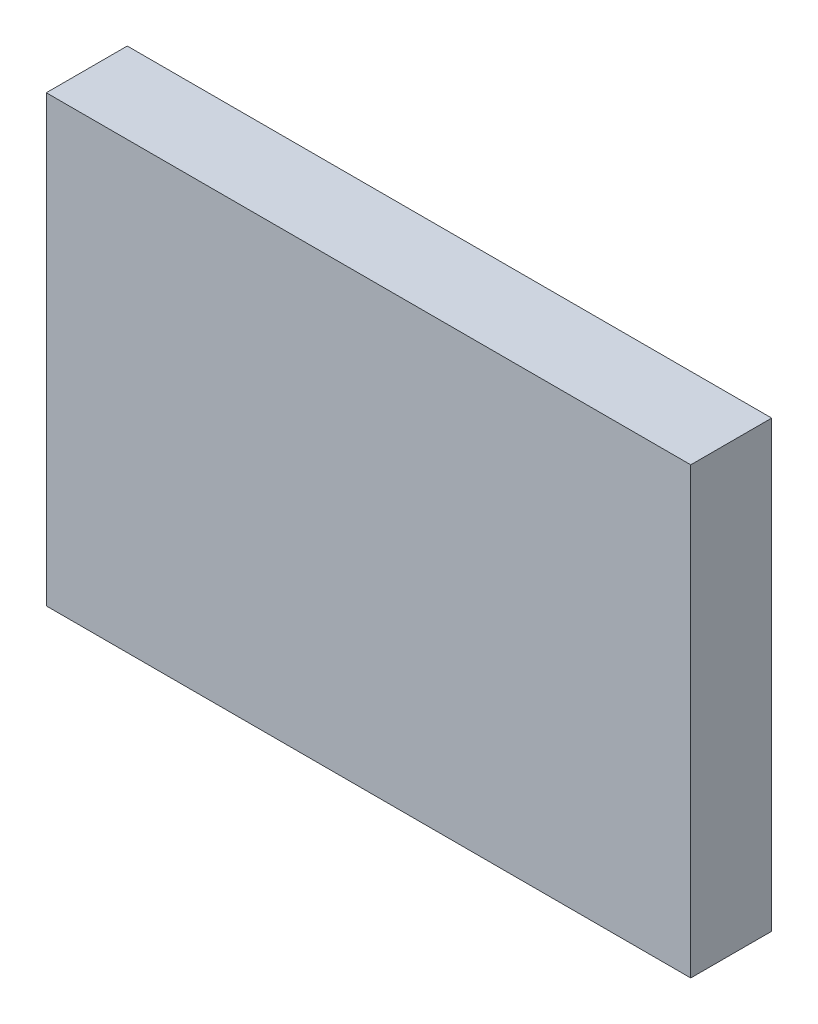
ISO-10303-21;
HEADER;
FILE_DESCRIPTION(('STEP AP214'),'2;1');
FILE_NAME('part.step','',(''),(''),'','','');
FILE_SCHEMA(('AUTOMOTIVE_DESIGN { 1 0 10303 214 1 1 1 1 }'));
ENDSEC;
DATA;
#1=APPLICATION_CONTEXT('core data for automotive mechanical design processes');
#2=APPLICATION_PROTOCOL_DEFINITION('international standard','automotive_design',2000,#1);
#3=PRODUCT_CONTEXT('',#1,'mechanical');
#4=PRODUCT('Part','Part','',(#3));
#5=PRODUCT_RELATED_PRODUCT_CATEGORY('part','',(#4));
#6=PRODUCT_DEFINITION_FORMATION('','',#4);
#7=PRODUCT_DEFINITION_CONTEXT('part definition',#1,'design');
#8=PRODUCT_DEFINITION('design','',#6,#7);
#9=PRODUCT_DEFINITION_SHAPE('','',#8);
#10=(LENGTH_UNIT() NAMED_UNIT(*) SI_UNIT(.MILLI.,.METRE.));
#11=(NAMED_UNIT(*) PLANE_ANGLE_UNIT() SI_UNIT($,.RADIAN.));
#12=(NAMED_UNIT(*) SI_UNIT($,.STERADIAN.) SOLID_ANGLE_UNIT());
#13=UNCERTAINTY_MEASURE_WITH_UNIT(LENGTH_MEASURE(1.E-05),#10,'distance_accuracy_value','');
#14=(GEOMETRIC_REPRESENTATION_CONTEXT(3) GLOBAL_UNCERTAINTY_ASSIGNED_CONTEXT((#13)) GLOBAL_UNIT_ASSIGNED_CONTEXT((#10,
#11,#12)) REPRESENTATION_CONTEXT('',''));
#15=CARTESIAN_POINT('',(0.,0.,0.));
#16=DIRECTION('',(0.,0.,1.));
#17=DIRECTION('',(1.,0.,0.));
#18=AXIS2_PLACEMENT_3D('',#15,#16,#17);
#19=CARTESIAN_POINT('',(-1.549,-0.14,0.));
#20=DIRECTION('',(0.,-1.,0.));
#21=DIRECTION('',(0.,0.,-1.));
#22=AXIS2_PLACEMENT_3D('',#19,#20,#21);
#23=PLANE('',#22);
#24=DIRECTION('',(-1.,0.,0.));
#25=VECTOR('',#24,1.);
#26=CARTESIAN_POINT('',(-1.143,-0.14,0.));
#27=LINE('',#26,#25);
#28=CARTESIAN_POINT('',(-1.143,-0.14,0.));
#29=VERTEX_POINT('',#28);
#30=CARTESIAN_POINT('',(-1.549,-0.14,0.));
#31=VERTEX_POINT('',#30);
#32=EDGE_CURVE('E11',#29,#31,#27,.T.);
#33=ORIENTED_EDGE('',*,*,#32,.F.);
#34=DIRECTION('',(0.,0.,-1.));
#35=VECTOR('',#34,1.);
#36=CARTESIAN_POINT('',(-1.143,-0.14,0.051));
#37=LINE('',#36,#35);
#38=CARTESIAN_POINT('',(-1.143,-0.14,0.051));
#39=VERTEX_POINT('',#38);
#40=EDGE_CURVE('E24',#39,#29,#37,.T.);
#41=ORIENTED_EDGE('',*,*,#40,.F.);
#42=DIRECTION('',(1.,0.,0.));
#43=VECTOR('',#42,1.);
#44=CARTESIAN_POINT('',(-1.549,-0.14,0.051));
#45=LINE('',#44,#43);
#46=CARTESIAN_POINT('',(-1.549,-0.14,0.051));
#47=VERTEX_POINT('',#46);
#48=EDGE_CURVE('E88',#47,#39,#45,.T.);
#49=ORIENTED_EDGE('',*,*,#48,.F.);
#50=DIRECTION('',(0.,0.,1.));
#51=VECTOR('',#50,1.);
#52=CARTESIAN_POINT('',(-1.549,-0.14,0.));
#53=LINE('',#52,#51);
#54=EDGE_CURVE('E77',#31,#47,#53,.T.);
#55=ORIENTED_EDGE('',*,*,#54,.F.);
#56=EDGE_LOOP('',(#33,#41,#49,#55));
#57=FACE_BOUND('',#56,.T.);
#58=ADVANCED_FACE('F17',(#57),#23,.T.);
#59=CARTESIAN_POINT('',(-1.143,-0.14,0.));
#60=DIRECTION('',(1.,0.,0.));
#61=DIRECTION('',(0.,1.,0.));
#62=AXIS2_PLACEMENT_3D('',#59,#60,#61);
#63=PLANE('',#62);
#64=DIRECTION('',(0.,-1.,0.));
#65=VECTOR('',#64,1.);
#66=CARTESIAN_POINT('',(-1.143,0.14,0.));
#67=LINE('',#66,#65);
#68=CARTESIAN_POINT('',(-1.143,0.14,0.));
#69=VERTEX_POINT('',#68);
#70=EDGE_CURVE('E85',#69,#29,#67,.T.);
#71=ORIENTED_EDGE('',*,*,#70,.F.);
#72=DIRECTION('',(0.,0.,-1.));
#73=VECTOR('',#72,1.);
#74=CARTESIAN_POINT('',(-1.143,0.14,0.051));
#75=LINE('',#74,#73);
#76=CARTESIAN_POINT('',(-1.143,0.14,0.051));
#77=VERTEX_POINT('',#76);
#78=EDGE_CURVE('E83',#77,#69,#75,.T.);
#79=ORIENTED_EDGE('',*,*,#78,.F.);
#80=DIRECTION('',(0.,1.,0.));
#81=VECTOR('',#80,1.);
#82=CARTESIAN_POINT('',(-1.143,-0.14,0.051));
#83=LINE('',#82,#81);
#84=EDGE_CURVE('E72',#39,#77,#83,.T.);
#85=ORIENTED_EDGE('',*,*,#84,.F.);
#86=ORIENTED_EDGE('',*,*,#40,.T.);
#87=EDGE_LOOP('',(#71,#79,#85,#86));
#88=FACE_BOUND('',#87,.T.);
#89=ADVANCED_FACE('F90',(#88),#63,.T.);
#90=CARTESIAN_POINT('',(-1.143,0.14,0.));
#91=DIRECTION('',(0.,1.,0.));
#92=DIRECTION('',(1.,0.,0.));
#93=AXIS2_PLACEMENT_3D('',#90,#91,#92);
#94=PLANE('',#93);
#95=DIRECTION('',(1.,0.,0.));
#96=VECTOR('',#95,1.);
#97=CARTESIAN_POINT('',(-1.549,0.14,0.));
#98=LINE('',#97,#96);
#99=CARTESIAN_POINT('',(-1.549,0.14,0.));
#100=VERTEX_POINT('',#99);
#101=EDGE_CURVE('E60',#100,#69,#98,.T.);
#102=ORIENTED_EDGE('',*,*,#101,.F.);
#103=DIRECTION('',(0.,0.,-1.));
#104=VECTOR('',#103,1.);
#105=CARTESIAN_POINT('',(-1.549,0.14,0.051));
#106=LINE('',#105,#104);
#107=CARTESIAN_POINT('',(-1.549,0.14,0.051));
#108=VERTEX_POINT('',#107);
#109=EDGE_CURVE('E54',#108,#100,#106,.T.);
#110=ORIENTED_EDGE('',*,*,#109,.F.);
#111=DIRECTION('',(-1.,0.,0.));
#112=VECTOR('',#111,1.);
#113=CARTESIAN_POINT('',(-1.143,0.14,0.051));
#114=LINE('',#113,#112);
#115=EDGE_CURVE('E58',#77,#108,#114,.T.);
#116=ORIENTED_EDGE('',*,*,#115,.F.);
#117=ORIENTED_EDGE('',*,*,#78,.T.);
#118=EDGE_LOOP('',(#102,#110,#116,#117));
#119=FACE_BOUND('',#118,.T.);
#120=ADVANCED_FACE('F56',(#119),#94,.T.);
#121=CARTESIAN_POINT('',(-1.549,0.14,0.));
#122=DIRECTION('',(-1.,0.,0.));
#123=DIRECTION('',(0.,0.,1.));
#124=AXIS2_PLACEMENT_3D('',#121,#122,#123);
#125=PLANE('',#124);
#126=DIRECTION('',(0.,1.,0.));
#127=VECTOR('',#126,1.);
#128=CARTESIAN_POINT('',(-1.549,-0.14,0.));
#129=LINE('',#128,#127);
#130=EDGE_CURVE('E73',#31,#100,#129,.T.);
#131=ORIENTED_EDGE('',*,*,#130,.F.);
#132=ORIENTED_EDGE('',*,*,#54,.T.);
#133=DIRECTION('',(0.,-1.,0.));
#134=VECTOR('',#133,1.);
#135=CARTESIAN_POINT('',(-1.549,0.14,0.051));
#136=LINE('',#135,#134);
#137=EDGE_CURVE('E70',#108,#47,#136,.T.);
#138=ORIENTED_EDGE('',*,*,#137,.F.);
#139=ORIENTED_EDGE('',*,*,#109,.T.);
#140=EDGE_LOOP('',(#131,#132,#138,#139));
#141=FACE_BOUND('',#140,.T.);
#142=ADVANCED_FACE('F76',(#141),#125,.T.);
#143=CARTESIAN_POINT('',(-1.549,0.14,0.));
#144=DIRECTION('',(0.,0.,-1.));
#145=DIRECTION('',(0.,-1.,0.));
#146=AXIS2_PLACEMENT_3D('',#143,#144,#145);
#147=PLANE('',#146);
#148=ORIENTED_EDGE('',*,*,#101,.T.);
#149=ORIENTED_EDGE('',*,*,#70,.T.);
#150=ORIENTED_EDGE('',*,*,#32,.T.);
#151=ORIENTED_EDGE('',*,*,#130,.T.);
#152=EDGE_LOOP('',(#148,#149,#150,#151));
#153=FACE_BOUND('',#152,.T.);
#154=ADVANCED_FACE('F91',(#153),#147,.T.);
#155=CARTESIAN_POINT('',(-1.549,-0.14,0.051));
#156=DIRECTION('',(0.,0.,1.));
#157=DIRECTION('',(1.,0.,0.));
#158=AXIS2_PLACEMENT_3D('',#155,#156,#157);
#159=PLANE('',#158);
#160=ORIENTED_EDGE('',*,*,#48,.T.);
#161=ORIENTED_EDGE('',*,*,#84,.T.);
#162=ORIENTED_EDGE('',*,*,#115,.T.);
#163=ORIENTED_EDGE('',*,*,#137,.T.);
#164=EDGE_LOOP('',(#160,#161,#162,#163));
#165=FACE_BOUND('',#164,.T.);
#166=ADVANCED_FACE('F69',(#165),#159,.T.);
#167=CLOSED_SHELL('',(#58,#89,#120,#142,#154,#166));
#168=MANIFOLD_SOLID_BREP('B1',#167);
#169=ADVANCED_BREP_SHAPE_REPRESENTATION('',(#18,#168),#14);
#170=SHAPE_DEFINITION_REPRESENTATION(#9,#169);
ENDSEC;
END-ISO-10303-21;
